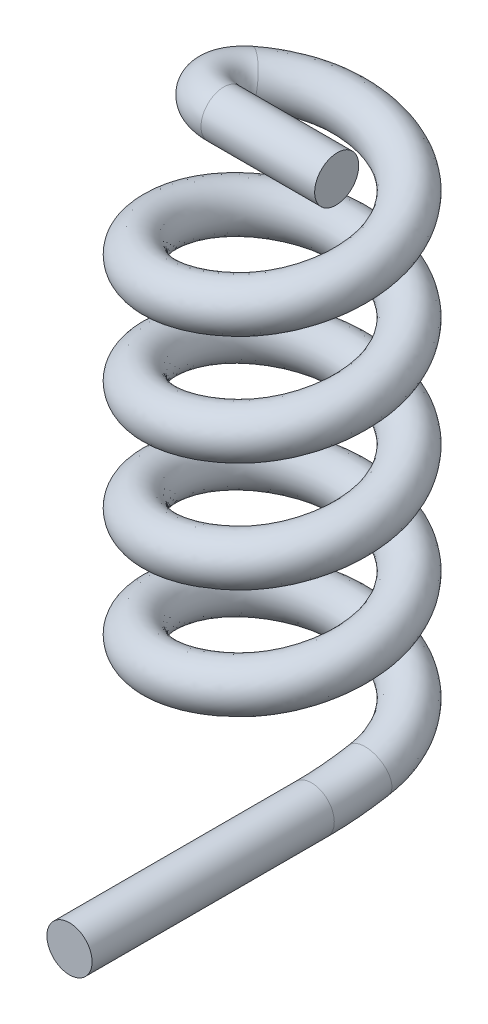
ISO-10303-21;
HEADER;
FILE_DESCRIPTION(('STEP AP214'),'2;1');
FILE_NAME('part.step','',(''),(''),'','','');
FILE_SCHEMA(('AUTOMOTIVE_DESIGN { 1 0 10303 214 1 1 1 1 }'));
ENDSEC;
DATA;
#1=APPLICATION_CONTEXT('core data for automotive mechanical design processes');
#2=APPLICATION_PROTOCOL_DEFINITION('international standard','automotive_design',2000,#1);
#3=PRODUCT_CONTEXT('',#1,'mechanical');
#4=PRODUCT('Part','Part','',(#3));
#5=PRODUCT_RELATED_PRODUCT_CATEGORY('part','',(#4));
#6=PRODUCT_DEFINITION_FORMATION('','',#4);
#7=PRODUCT_DEFINITION_CONTEXT('part definition',#1,'design');
#8=PRODUCT_DEFINITION('design','',#6,#7);
#9=PRODUCT_DEFINITION_SHAPE('','',#8);
#10=(LENGTH_UNIT() NAMED_UNIT(*) SI_UNIT(.MILLI.,.METRE.));
#11=(NAMED_UNIT(*) PLANE_ANGLE_UNIT() SI_UNIT($,.RADIAN.));
#12=(NAMED_UNIT(*) SI_UNIT($,.STERADIAN.) SOLID_ANGLE_UNIT());
#13=UNCERTAINTY_MEASURE_WITH_UNIT(LENGTH_MEASURE(1.E-05),#10,'distance_accuracy_value','');
#14=(GEOMETRIC_REPRESENTATION_CONTEXT(3) GLOBAL_UNCERTAINTY_ASSIGNED_CONTEXT((#13)) GLOBAL_UNIT_ASSIGNED_CONTEXT((#10,
#11,#12)) REPRESENTATION_CONTEXT('',''));
#15=CARTESIAN_POINT('',(0.,0.,0.));
#16=DIRECTION('',(0.,0.,1.));
#17=DIRECTION('',(1.,0.,0.));
#18=AXIS2_PLACEMENT_3D('',#15,#16,#17);
#19=CARTESIAN_POINT('',(0.6,1.96823762445943,0.35502204672712));
#20=DIRECTION('',(1.,0.,0.));
#21=DIRECTION('',(0.,0.,-1.));
#22=AXIS2_PLACEMENT_3D('',#19,#20,#21);
#23=TOROIDAL_SURFACE('',#22,2.,0.14);
#24=CARTESIAN_POINT('',(0.6,-0.0317623755405736,0.35502204672712));
#25=DIRECTION('',(0.,0.,1.));
#26=DIRECTION('',(1.,0.,0.));
#27=AXIS2_PLACEMENT_3D('',#24,#25,#26);
#28=CIRCLE('',#27,0.14);
#29=CARTESIAN_POINT('',(0.6,-0.171762375540574,0.35502204672712));
#30=VERTEX_POINT('',#29);
#31=EDGE_CURVE('E10',#30,#30,#28,.T.);
#32=CARTESIAN_POINT('',(0.6,0.,0.));
#33=DIRECTION('',(0.,0.17751102336356,-0.984118812229713));
#34=DIRECTION('',(0.,0.984118812229713,0.17751102336356));
#35=AXIS2_PLACEMENT_3D('',#32,#33,#34);
#36=CIRCLE('',#35,0.14);
#37=CARTESIAN_POINT('',(0.6,-0.13777663371216,-0.0248515432708984));
#38=VERTEX_POINT('',#37);
#39=EDGE_CURVE('E43',#38,#38,#36,.T.);
#40=CARTESIAN_POINT('',(0.6,1.96823762445943,0.35502204672712));
#41=DIRECTION('',(1.,0.,0.));
#42=DIRECTION('',(0.,0.,-1.));
#43=AXIS2_PLACEMENT_3D('',#40,#41,#42);
#44=CIRCLE('',#43,2.14);
#45=EDGE_CURVE('',#30,#38,#44,.T.);
#46=ORIENTED_EDGE('',*,*,#31,.F.);
#47=ORIENTED_EDGE('',*,*,#39,.F.);
#48=ORIENTED_EDGE('',*,*,#45,.T.);
#49=ORIENTED_EDGE('',*,*,#45,.F.);
#50=EDGE_LOOP('',(#46,#48,#47,#49));
#51=FACE_BOUND('',#50,.T.);
#52=ADVANCED_FACE('F29',(#51),#23,.T.);
#53=CARTESIAN_POINT('',(0.6,-0.0317623755405736,0.35502204672712));
#54=DIRECTION('',(0.,0.,1.));
#55=DIRECTION('',(0.,-1.,0.));
#56=AXIS2_PLACEMENT_3D('',#53,#54,#55);
#57=CYLINDRICAL_SURFACE('',#56,0.14);
#58=ORIENTED_EDGE('',*,*,#31,.T.);
#59=EDGE_LOOP('',(#58));
#60=FACE_BOUND('',#59,.T.);
#61=CARTESIAN_POINT('',(0.6,-0.0317623755405738,1.85502204672712));
#62=DIRECTION('',(0.,0.,1.));
#63=DIRECTION('',(1.,0.,0.));
#64=AXIS2_PLACEMENT_3D('',#61,#62,#63);
#65=CIRCLE('',#64,0.14);
#66=CARTESIAN_POINT('',(0.74,-0.0317623755405738,1.85502204672712));
#67=VERTEX_POINT('',#66);
#68=EDGE_CURVE('E37',#67,#67,#65,.T.);
#69=ORIENTED_EDGE('',*,*,#68,.F.);
#70=EDGE_LOOP('',(#69));
#71=FACE_BOUND('',#70,.T.);
#72=ADVANCED_FACE('F78',(#60,#71),#57,.T.);
#73=CARTESIAN_POINT('',(0.6,-0.0317623755405738,1.85502204672712));
#74=DIRECTION('',(0.,0.,1.));
#75=DIRECTION('',(1.,0.,0.));
#76=AXIS2_PLACEMENT_3D('',#73,#74,#75);
#77=PLANE('',#76);
#78=ORIENTED_EDGE('',*,*,#68,.T.);
#79=EDGE_LOOP('',(#78));
#80=FACE_BOUND('',#79,.T.);
#81=ADVANCED_FACE('F67',(#80),#77,.T.);
#82=CARTESIAN_POINT('',(0.6,0.13777663371216,0.0248515432708983));
#83=CARTESIAN_POINT('',(0.614348045197231,0.194443300378826,-0.321558618242877));
#84=CARTESIAN_POINT('',(0.321522067795846,0.251109967045493,-0.507189470635214));
#85=CARTESIAN_POINT('',(0.0286960903944616,0.307776633712159,-0.692820323027551));
#86=CARTESIAN_POINT('',(-0.278477932204154,0.364443300378826,-0.532041013906112));
#87=CARTESIAN_POINT('',(-0.585651954802769,0.421109967045492,-0.371261704784674));
#88=CARTESIAN_POINT('',(-0.6,0.477776633712159,-0.0248515432708984));
#89=CARTESIAN_POINT('',(-0.614348045197231,0.534443300378825,0.321558618242877));
#90=CARTESIAN_POINT('',(-0.321522067795846,0.591109967045492,0.507189470635214));
#91=CARTESIAN_POINT('',(-0.0286960903944617,0.647776633712159,0.692820323027551));
#92=CARTESIAN_POINT('',(0.278477932204153,0.704443300378825,0.532041013906112));
#93=CARTESIAN_POINT('',(0.585651954802769,0.761109967045492,0.371261704784674));
#94=CARTESIAN_POINT('',(0.6,0.817776633712158,0.0248515432708983));
#95=CARTESIAN_POINT('',(0.614348045197231,0.874443300378825,-0.321558618242877));
#96=CARTESIAN_POINT('',(0.321522067795846,0.931109967045491,-0.507189470635214));
#97=CARTESIAN_POINT('',(0.0286960903944616,0.987776633712158,-0.692820323027551));
#98=CARTESIAN_POINT('',(-0.278477932204154,1.04444330037882,-0.532041013906112));
#99=CARTESIAN_POINT('',(-0.585651954802769,1.10110996704549,-0.371261704784674));
#100=CARTESIAN_POINT('',(-0.6,1.15777663371216,-0.0248515432708984));
#101=CARTESIAN_POINT('',(-0.614348045197231,1.21444330037882,0.321558618242877));
#102=CARTESIAN_POINT('',(-0.321522067795846,1.27110996704549,0.507189470635214));
#103=CARTESIAN_POINT('',(-0.0286960903944617,1.32777663371216,0.692820323027551));
#104=CARTESIAN_POINT('',(0.278477932204153,1.38444330037882,0.532041013906112));
#105=CARTESIAN_POINT('',(0.585651954802769,1.44110996704549,0.371261704784674));
#106=CARTESIAN_POINT('',(0.6,1.49777663371216,0.0248515432708983));
#107=CARTESIAN_POINT('',(0.614348045197231,1.55444330037882,-0.321558618242877));
#108=CARTESIAN_POINT('',(0.321522067795846,1.61110996704549,-0.507189470635214));
#109=CARTESIAN_POINT('',(0.0286960903944616,1.66777663371216,-0.692820323027551));
#110=CARTESIAN_POINT('',(-0.278477932204154,1.72444330037882,-0.532041013906112));
#111=CARTESIAN_POINT('',(-0.585651954802769,1.78110996704549,-0.371261704784674));
#112=CARTESIAN_POINT('',(-0.6,1.83777663371216,-0.0248515432708984));
#113=CARTESIAN_POINT('',(-0.614348045197231,1.89444330037882,0.321558618242877));
#114=CARTESIAN_POINT('',(-0.321522067795846,1.95110996704549,0.507189470635214));
#115=CARTESIAN_POINT('',(-0.0286960903944617,2.00777663371216,0.692820323027551));
#116=CARTESIAN_POINT('',(0.278477932204153,2.06444330037882,0.532041013906112));
#117=CARTESIAN_POINT('',(0.585651954802769,2.12110996704549,0.371261704784674));
#118=CARTESIAN_POINT('',(0.6,2.17777663371215,0.0248515432708983));
#119=CARTESIAN_POINT('',(0.614348045197231,2.23444330037882,-0.321558618242877));
#120=CARTESIAN_POINT('',(0.321522067795846,2.29110996704549,-0.507189470635214));
#121=CARTESIAN_POINT('',(0.0286960903944616,2.34777663371215,-0.692820323027551));
#122=CARTESIAN_POINT('',(-0.278477932204154,2.40444330037882,-0.532041013906112));
#123=CARTESIAN_POINT('',(-0.585651954802769,2.46110996704549,-0.371261704784674));
#124=CARTESIAN_POINT('',(-0.6,2.51777663371215,-0.0248515432708984));
#125=CARTESIAN_POINT('',(-0.614348045197231,2.57444330037882,0.321558618242877));
#126=CARTESIAN_POINT('',(-0.321522067795846,2.63110996704549,0.507189470635214));
#127=CARTESIAN_POINT('',(-0.0286960903944617,2.68777663371215,0.692820323027551));
#128=CARTESIAN_POINT('',(0.278477932204153,2.74444330037882,0.532041013906112));
#129=CARTESIAN_POINT('',(0.585651954802769,2.80110996704549,0.371261704784674));
#130=CARTESIAN_POINT('',(0.6,2.85777663371215,0.0248515432708983));
#131=CARTESIAN_POINT('',(0.614348045197231,2.91444330037882,-0.321558618242877));
#132=CARTESIAN_POINT('',(0.321522067795846,2.97110996704549,-0.507189470635214));
#133=CARTESIAN_POINT('',(0.0286960903944616,3.02777663371215,-0.692820323027551));
#134=CARTESIAN_POINT('',(-0.278477932204154,3.08444330037882,-0.532041013906112));
#135=CARTESIAN_POINT('',(-0.585651954802769,3.14110996704549,-0.371261704784674));
#136=CARTESIAN_POINT('',(-0.6,3.19777663371215,-0.0248515432708984));
#137=CARTESIAN_POINT('',(-0.614348045197231,3.25444330037882,0.321558618242877));
#138=CARTESIAN_POINT('',(-0.321522067795846,3.31110996704549,0.507189470635214));
#139=CARTESIAN_POINT('',(-0.0286960903944617,3.36777663371215,0.692820323027551));
#140=CARTESIAN_POINT('',(0.278477932204153,3.42444330037882,0.532041013906112));
#141=CARTESIAN_POINT('',(0.585651954802769,3.48110996704549,0.371261704784674));
#142=CARTESIAN_POINT('',(0.6,3.53777663371215,0.0248515432708983));
#143=CARTESIAN_POINT('',(0.88,0.13777663371216,0.0248515432708983));
#144=CARTESIAN_POINT('',(0.894348045197231,0.194443300378826,-0.483216693615972));
#145=CARTESIAN_POINT('',(0.461522067795846,0.251109967045493,-0.749676583694857));
#146=CARTESIAN_POINT('',(0.0286960903944616,0.307776633712159,-1.01613647377374));
#147=CARTESIAN_POINT('',(-0.418477932204153,0.364443300378826,-0.774528126965755));
#148=CARTESIAN_POINT('',(-0.865651954802769,0.421109967045492,-0.532919780157769));
#149=CARTESIAN_POINT('',(-0.88,0.477776633712159,-0.0248515432708984));
#150=CARTESIAN_POINT('',(-0.894348045197231,0.534443300378825,0.483216693615972));
#151=CARTESIAN_POINT('',(-0.461522067795846,0.591109967045492,0.749676583694856));
#152=CARTESIAN_POINT('',(-0.0286960903944618,0.647776633712159,1.01613647377374));
#153=CARTESIAN_POINT('',(0.418477932204153,0.704443300378825,0.774528126965755));
#154=CARTESIAN_POINT('',(0.865651954802769,0.761109967045492,0.532919780157769));
#155=CARTESIAN_POINT('',(0.88,0.817776633712158,0.0248515432708983));
#156=CARTESIAN_POINT('',(0.894348045197231,0.874443300378825,-0.483216693615972));
#157=CARTESIAN_POINT('',(0.461522067795846,0.931109967045491,-0.749676583694857));
#158=CARTESIAN_POINT('',(0.0286960903944616,0.987776633712158,-1.01613647377374));
#159=CARTESIAN_POINT('',(-0.418477932204153,1.04444330037882,-0.774528126965755));
#160=CARTESIAN_POINT('',(-0.865651954802769,1.10110996704549,-0.532919780157769));
#161=CARTESIAN_POINT('',(-0.88,1.15777663371216,-0.0248515432708984));
#162=CARTESIAN_POINT('',(-0.894348045197231,1.21444330037882,0.483216693615972));
#163=CARTESIAN_POINT('',(-0.461522067795846,1.27110996704549,0.749676583694856));
#164=CARTESIAN_POINT('',(-0.0286960903944618,1.32777663371216,1.01613647377374));
#165=CARTESIAN_POINT('',(0.418477932204153,1.38444330037882,0.774528126965755));
#166=CARTESIAN_POINT('',(0.865651954802769,1.44110996704549,0.532919780157769));
#167=CARTESIAN_POINT('',(0.88,1.49777663371216,0.0248515432708983));
#168=CARTESIAN_POINT('',(0.894348045197231,1.55444330037882,-0.483216693615972));
#169=CARTESIAN_POINT('',(0.461522067795846,1.61110996704549,-0.749676583694857));
#170=CARTESIAN_POINT('',(0.0286960903944616,1.66777663371216,-1.01613647377374));
#171=CARTESIAN_POINT('',(-0.418477932204153,1.72444330037882,-0.774528126965755));
#172=CARTESIAN_POINT('',(-0.865651954802769,1.78110996704549,-0.532919780157769));
#173=CARTESIAN_POINT('',(-0.88,1.83777663371216,-0.0248515432708984));
#174=CARTESIAN_POINT('',(-0.894348045197231,1.89444330037882,0.483216693615972));
#175=CARTESIAN_POINT('',(-0.461522067795846,1.95110996704549,0.749676583694856));
#176=CARTESIAN_POINT('',(-0.0286960903944618,2.00777663371216,1.01613647377374));
#177=CARTESIAN_POINT('',(0.418477932204153,2.06444330037882,0.774528126965755));
#178=CARTESIAN_POINT('',(0.865651954802769,2.12110996704549,0.532919780157769));
#179=CARTESIAN_POINT('',(0.88,2.17777663371215,0.0248515432708983));
#180=CARTESIAN_POINT('',(0.894348045197231,2.23444330037882,-0.483216693615972));
#181=CARTESIAN_POINT('',(0.461522067795846,2.29110996704549,-0.749676583694857));
#182=CARTESIAN_POINT('',(0.0286960903944616,2.34777663371215,-1.01613647377374));
#183=CARTESIAN_POINT('',(-0.418477932204153,2.40444330037882,-0.774528126965755));
#184=CARTESIAN_POINT('',(-0.865651954802769,2.46110996704549,-0.532919780157769));
#185=CARTESIAN_POINT('',(-0.88,2.51777663371215,-0.0248515432708984));
#186=CARTESIAN_POINT('',(-0.894348045197231,2.57444330037882,0.483216693615972));
#187=CARTESIAN_POINT('',(-0.461522067795846,2.63110996704549,0.749676583694856));
#188=CARTESIAN_POINT('',(-0.0286960903944618,2.68777663371215,1.01613647377374));
#189=CARTESIAN_POINT('',(0.418477932204153,2.74444330037882,0.774528126965755));
#190=CARTESIAN_POINT('',(0.865651954802769,2.80110996704549,0.532919780157769));
#191=CARTESIAN_POINT('',(0.88,2.85777663371215,0.0248515432708983));
#192=CARTESIAN_POINT('',(0.894348045197231,2.91444330037882,-0.483216693615972));
#193=CARTESIAN_POINT('',(0.461522067795846,2.97110996704549,-0.749676583694857));
#194=CARTESIAN_POINT('',(0.0286960903944616,3.02777663371215,-1.01613647377374));
#195=CARTESIAN_POINT('',(-0.418477932204153,3.08444330037882,-0.774528126965755));
#196=CARTESIAN_POINT('',(-0.865651954802769,3.14110996704549,-0.532919780157769));
#197=CARTESIAN_POINT('',(-0.88,3.19777663371215,-0.0248515432708984));
#198=CARTESIAN_POINT('',(-0.894348045197231,3.25444330037882,0.483216693615972));
#199=CARTESIAN_POINT('',(-0.461522067795846,3.31110996704549,0.749676583694856));
#200=CARTESIAN_POINT('',(-0.0286960903944618,3.36777663371215,1.01613647377374));
#201=CARTESIAN_POINT('',(0.418477932204153,3.42444330037882,0.774528126965755));
#202=CARTESIAN_POINT('',(0.865651954802769,3.48110996704549,0.532919780157769));
#203=CARTESIAN_POINT('',(0.88,3.53777663371215,0.0248515432708983));
#204=CARTESIAN_POINT('',(0.88,-0.13777663371216,-0.0248515432708984));
#205=CARTESIAN_POINT('',(0.865651954802769,-0.0811099670454935,-0.532919780157769));
#206=CARTESIAN_POINT('',(0.418477932204154,-0.0244433003788269,-0.774528126965755));
#207=CARTESIAN_POINT('',(-0.0286960903944616,0.0322233662878396,-1.01613647377374));
#208=CARTESIAN_POINT('',(-0.461522067795846,0.0888900329545061,-0.749676583694857));
#209=CARTESIAN_POINT('',(-0.89434804519723,0.145556699621173,-0.483216693615973));
#210=CARTESIAN_POINT('',(-0.88,0.202223366287839,0.0248515432708983));
#211=CARTESIAN_POINT('',(-0.865651954802769,0.258890032954506,0.532919780157769));
#212=CARTESIAN_POINT('',(-0.418477932204154,0.315556699621172,0.774528126965755));
#213=CARTESIAN_POINT('',(0.0286960903944615,0.372223366287839,1.01613647377374));
#214=CARTESIAN_POINT('',(0.461522067795846,0.428890032954505,0.749676583694857));
#215=CARTESIAN_POINT('',(0.89434804519723,0.485556699621172,0.483216693615973));
#216=CARTESIAN_POINT('',(0.88,0.542223366287839,-0.0248515432708984));
#217=CARTESIAN_POINT('',(0.865651954802769,0.598890032954505,-0.532919780157769));
#218=CARTESIAN_POINT('',(0.418477932204154,0.655556699621171,-0.774528126965755));
#219=CARTESIAN_POINT('',(-0.0286960903944616,0.712223366287838,-1.01613647377374));
#220=CARTESIAN_POINT('',(-0.461522067795846,0.768890032954505,-0.749676583694857));
#221=CARTESIAN_POINT('',(-0.89434804519723,0.825556699621171,-0.483216693615973));
#222=CARTESIAN_POINT('',(-0.88,0.882223366287838,0.0248515432708983));
#223=CARTESIAN_POINT('',(-0.865651954802769,0.938890032954504,0.532919780157769));
#224=CARTESIAN_POINT('',(-0.418477932204154,0.995556699621171,0.774528126965755));
#225=CARTESIAN_POINT('',(0.0286960903944615,1.05222336628784,1.01613647377374));
#226=CARTESIAN_POINT('',(0.461522067795846,1.1088900329545,0.749676583694857));
#227=CARTESIAN_POINT('',(0.89434804519723,1.16555669962117,0.483216693615973));
#228=CARTESIAN_POINT('',(0.88,1.22222336628784,-0.0248515432708984));
#229=CARTESIAN_POINT('',(0.865651954802769,1.2788900329545,-0.532919780157769));
#230=CARTESIAN_POINT('',(0.418477932204154,1.33555669962117,-0.774528126965755));
#231=CARTESIAN_POINT('',(-0.0286960903944616,1.39222336628784,-1.01613647377374));
#232=CARTESIAN_POINT('',(-0.461522067795846,1.4488900329545,-0.749676583694857));
#233=CARTESIAN_POINT('',(-0.89434804519723,1.50555669962117,-0.483216693615973));
#234=CARTESIAN_POINT('',(-0.88,1.56222336628784,0.0248515432708983));
#235=CARTESIAN_POINT('',(-0.865651954802769,1.6188900329545,0.532919780157769));
#236=CARTESIAN_POINT('',(-0.418477932204154,1.67555669962117,0.774528126965755));
#237=CARTESIAN_POINT('',(0.0286960903944615,1.73222336628784,1.01613647377374));
#238=CARTESIAN_POINT('',(0.461522067795846,1.7888900329545,0.749676583694857));
#239=CARTESIAN_POINT('',(0.89434804519723,1.84555669962117,0.483216693615973));
#240=CARTESIAN_POINT('',(0.88,1.90222336628784,-0.0248515432708984));
#241=CARTESIAN_POINT('',(0.865651954802769,1.9588900329545,-0.532919780157769));
#242=CARTESIAN_POINT('',(0.418477932204154,2.01555669962117,-0.774528126965755));
#243=CARTESIAN_POINT('',(-0.0286960903944616,2.07222336628783,-1.01613647377374));
#244=CARTESIAN_POINT('',(-0.461522067795846,2.1288900329545,-0.749676583694857));
#245=CARTESIAN_POINT('',(-0.89434804519723,2.18555669962117,-0.483216693615973));
#246=CARTESIAN_POINT('',(-0.88,2.24222336628783,0.0248515432708983));
#247=CARTESIAN_POINT('',(-0.865651954802769,2.2988900329545,0.532919780157769));
#248=CARTESIAN_POINT('',(-0.418477932204154,2.35555669962117,0.774528126965755));
#249=CARTESIAN_POINT('',(0.0286960903944615,2.41222336628783,1.01613647377374));
#250=CARTESIAN_POINT('',(0.461522067795846,2.4688900329545,0.749676583694857));
#251=CARTESIAN_POINT('',(0.89434804519723,2.52555669962117,0.483216693615973));
#252=CARTESIAN_POINT('',(0.88,2.58222336628783,-0.0248515432708984));
#253=CARTESIAN_POINT('',(0.865651954802769,2.6388900329545,-0.532919780157769));
#254=CARTESIAN_POINT('',(0.418477932204154,2.69555669962117,-0.774528126965755));
#255=CARTESIAN_POINT('',(-0.0286960903944616,2.75222336628783,-1.01613647377374));
#256=CARTESIAN_POINT('',(-0.461522067795846,2.8088900329545,-0.749676583694857));
#257=CARTESIAN_POINT('',(-0.89434804519723,2.86555669962117,-0.483216693615973));
#258=CARTESIAN_POINT('',(-0.88,2.92222336628783,0.0248515432708983));
#259=CARTESIAN_POINT('',(-0.865651954802769,2.9788900329545,0.532919780157769));
#260=CARTESIAN_POINT('',(-0.418477932204154,3.03555669962117,0.774528126965755));
#261=CARTESIAN_POINT('',(0.0286960903944615,3.09222336628783,1.01613647377374));
#262=CARTESIAN_POINT('',(0.461522067795846,3.1488900329545,0.749676583694857));
#263=CARTESIAN_POINT('',(0.89434804519723,3.20555669962117,0.483216693615973));
#264=CARTESIAN_POINT('',(0.88,3.26222336628783,-0.0248515432708984));
#265=CARTESIAN_POINT('',(0.6,-0.13777663371216,-0.0248515432708984));
#266=CARTESIAN_POINT('',(0.585651954802769,-0.0811099670454935,-0.371261704784674));
#267=CARTESIAN_POINT('',(0.278477932204154,-0.024443300378827,-0.532041013906112));
#268=CARTESIAN_POINT('',(-0.0286960903944616,0.0322233662878396,-0.692820323027551));
#269=CARTESIAN_POINT('',(-0.321522067795846,0.0888900329545061,-0.507189470635214));
#270=CARTESIAN_POINT('',(-0.614348045197231,0.145556699621173,-0.321558618242877));
#271=CARTESIAN_POINT('',(-0.6,0.202223366287839,0.0248515432708983));
#272=CARTESIAN_POINT('',(-0.585651954802769,0.258890032954506,0.371261704784674));
#273=CARTESIAN_POINT('',(-0.278477932204154,0.315556699621172,0.532041013906112));
#274=CARTESIAN_POINT('',(0.0286960903944615,0.372223366287839,0.692820323027551));
#275=CARTESIAN_POINT('',(0.321522067795846,0.428890032954505,0.507189470635214));
#276=CARTESIAN_POINT('',(0.614348045197231,0.485556699621172,0.321558618242877));
#277=CARTESIAN_POINT('',(0.6,0.542223366287839,-0.0248515432708984));
#278=CARTESIAN_POINT('',(0.585651954802769,0.598890032954505,-0.371261704784674));
#279=CARTESIAN_POINT('',(0.278477932204154,0.655556699621171,-0.532041013906112));
#280=CARTESIAN_POINT('',(-0.0286960903944616,0.712223366287838,-0.692820323027551));
#281=CARTESIAN_POINT('',(-0.321522067795846,0.768890032954505,-0.507189470635214));
#282=CARTESIAN_POINT('',(-0.614348045197231,0.825556699621171,-0.321558618242877));
#283=CARTESIAN_POINT('',(-0.6,0.882223366287838,0.0248515432708983));
#284=CARTESIAN_POINT('',(-0.585651954802769,0.938890032954504,0.371261704784674));
#285=CARTESIAN_POINT('',(-0.278477932204154,0.995556699621171,0.532041013906112));
#286=CARTESIAN_POINT('',(0.0286960903944615,1.05222336628784,0.692820323027551));
#287=CARTESIAN_POINT('',(0.321522067795846,1.1088900329545,0.507189470635214));
#288=CARTESIAN_POINT('',(0.614348045197231,1.16555669962117,0.321558618242877));
#289=CARTESIAN_POINT('',(0.6,1.22222336628784,-0.0248515432708984));
#290=CARTESIAN_POINT('',(0.585651954802769,1.2788900329545,-0.371261704784674));
#291=CARTESIAN_POINT('',(0.278477932204154,1.33555669962117,-0.532041013906112));
#292=CARTESIAN_POINT('',(-0.0286960903944616,1.39222336628784,-0.692820323027551));
#293=CARTESIAN_POINT('',(-0.321522067795846,1.4488900329545,-0.507189470635214));
#294=CARTESIAN_POINT('',(-0.614348045197231,1.50555669962117,-0.321558618242877));
#295=CARTESIAN_POINT('',(-0.6,1.56222336628784,0.0248515432708983));
#296=CARTESIAN_POINT('',(-0.585651954802769,1.6188900329545,0.371261704784674));
#297=CARTESIAN_POINT('',(-0.278477932204154,1.67555669962117,0.532041013906112));
#298=CARTESIAN_POINT('',(0.0286960903944615,1.73222336628784,0.692820323027551));
#299=CARTESIAN_POINT('',(0.321522067795846,1.7888900329545,0.507189470635214));
#300=CARTESIAN_POINT('',(0.614348045197231,1.84555669962117,0.321558618242877));
#301=CARTESIAN_POINT('',(0.6,1.90222336628784,-0.0248515432708984));
#302=CARTESIAN_POINT('',(0.585651954802769,1.9588900329545,-0.371261704784674));
#303=CARTESIAN_POINT('',(0.278477932204154,2.01555669962117,-0.532041013906112));
#304=CARTESIAN_POINT('',(-0.0286960903944616,2.07222336628783,-0.692820323027551));
#305=CARTESIAN_POINT('',(-0.321522067795846,2.1288900329545,-0.507189470635214));
#306=CARTESIAN_POINT('',(-0.614348045197231,2.18555669962117,-0.321558618242877));
#307=CARTESIAN_POINT('',(-0.6,2.24222336628783,0.0248515432708983));
#308=CARTESIAN_POINT('',(-0.585651954802769,2.2988900329545,0.371261704784674));
#309=CARTESIAN_POINT('',(-0.278477932204154,2.35555669962117,0.532041013906112));
#310=CARTESIAN_POINT('',(0.0286960903944615,2.41222336628783,0.692820323027551));
#311=CARTESIAN_POINT('',(0.321522067795846,2.4688900329545,0.507189470635214));
#312=CARTESIAN_POINT('',(0.614348045197231,2.52555669962117,0.321558618242877));
#313=CARTESIAN_POINT('',(0.6,2.58222336628783,-0.0248515432708984));
#314=CARTESIAN_POINT('',(0.585651954802769,2.6388900329545,-0.371261704784674));
#315=CARTESIAN_POINT('',(0.278477932204154,2.69555669962117,-0.532041013906112));
#316=CARTESIAN_POINT('',(-0.0286960903944616,2.75222336628783,-0.692820323027551));
#317=CARTESIAN_POINT('',(-0.321522067795846,2.8088900329545,-0.507189470635214));
#318=CARTESIAN_POINT('',(-0.614348045197231,2.86555669962117,-0.321558618242877));
#319=CARTESIAN_POINT('',(-0.6,2.92222336628783,0.0248515432708983));
#320=CARTESIAN_POINT('',(-0.585651954802769,2.9788900329545,0.371261704784674));
#321=CARTESIAN_POINT('',(-0.278477932204154,3.03555669962117,0.532041013906112));
#322=CARTESIAN_POINT('',(0.0286960903944615,3.09222336628783,0.692820323027551));
#323=CARTESIAN_POINT('',(0.321522067795846,3.1488900329545,0.507189470635214));
#324=CARTESIAN_POINT('',(0.614348045197231,3.20555669962117,0.321558618242877));
#325=CARTESIAN_POINT('',(0.6,3.26222336628783,-0.0248515432708984));
#326=CARTESIAN_POINT('',(0.32,-0.13777663371216,-0.0248515432708984));
#327=CARTESIAN_POINT('',(0.305651954802769,-0.0811099670454936,-0.209603629411579));
#328=CARTESIAN_POINT('',(0.138477932204154,-0.024443300378827,-0.28955390084647));
#329=CARTESIAN_POINT('',(-0.0286960903944616,0.0322233662878396,-0.36950417228136));
#330=CARTESIAN_POINT('',(-0.181522067795846,0.0888900329545061,-0.264702357575571));
#331=CARTESIAN_POINT('',(-0.334348045197231,0.145556699621173,-0.159900542869782));
#332=CARTESIAN_POINT('',(-0.32,0.202223366287839,0.0248515432708984));
#333=CARTESIAN_POINT('',(-0.305651954802769,0.258890032954506,0.209603629411579));
#334=CARTESIAN_POINT('',(-0.138477932204154,0.315556699621172,0.289553900846469));
#335=CARTESIAN_POINT('',(0.0286960903944616,0.372223366287839,0.36950417228136));
#336=CARTESIAN_POINT('',(0.181522067795846,0.428890032954505,0.264702357575571));
#337=CARTESIAN_POINT('',(0.334348045197231,0.485556699621172,0.159900542869782));
#338=CARTESIAN_POINT('',(0.32,0.542223366287839,-0.0248515432708984));
#339=CARTESIAN_POINT('',(0.305651954802769,0.598890032954505,-0.209603629411579));
#340=CARTESIAN_POINT('',(0.138477932204154,0.655556699621171,-0.28955390084647));
#341=CARTESIAN_POINT('',(-0.0286960903944616,0.712223366287838,-0.36950417228136));
#342=CARTESIAN_POINT('',(-0.181522067795846,0.768890032954505,-0.264702357575571));
#343=CARTESIAN_POINT('',(-0.334348045197231,0.825556699621171,-0.159900542869782));
#344=CARTESIAN_POINT('',(-0.32,0.882223366287838,0.0248515432708984));
#345=CARTESIAN_POINT('',(-0.305651954802769,0.938890032954504,0.209603629411579));
#346=CARTESIAN_POINT('',(-0.138477932204154,0.995556699621171,0.289553900846469));
#347=CARTESIAN_POINT('',(0.0286960903944616,1.05222336628784,0.36950417228136));
#348=CARTESIAN_POINT('',(0.181522067795846,1.1088900329545,0.264702357575571));
#349=CARTESIAN_POINT('',(0.334348045197231,1.16555669962117,0.159900542869782));
#350=CARTESIAN_POINT('',(0.32,1.22222336628784,-0.0248515432708984));
#351=CARTESIAN_POINT('',(0.305651954802769,1.2788900329545,-0.209603629411579));
#352=CARTESIAN_POINT('',(0.138477932204154,1.33555669962117,-0.28955390084647));
#353=CARTESIAN_POINT('',(-0.0286960903944616,1.39222336628784,-0.36950417228136));
#354=CARTESIAN_POINT('',(-0.181522067795846,1.4488900329545,-0.264702357575571));
#355=CARTESIAN_POINT('',(-0.334348045197231,1.50555669962117,-0.159900542869782));
#356=CARTESIAN_POINT('',(-0.32,1.56222336628784,0.0248515432708984));
#357=CARTESIAN_POINT('',(-0.305651954802769,1.6188900329545,0.209603629411579));
#358=CARTESIAN_POINT('',(-0.138477932204154,1.67555669962117,0.289553900846469));
#359=CARTESIAN_POINT('',(0.0286960903944616,1.73222336628784,0.36950417228136));
#360=CARTESIAN_POINT('',(0.181522067795846,1.7888900329545,0.264702357575571));
#361=CARTESIAN_POINT('',(0.334348045197231,1.84555669962117,0.159900542869782));
#362=CARTESIAN_POINT('',(0.32,1.90222336628784,-0.0248515432708984));
#363=CARTESIAN_POINT('',(0.305651954802769,1.9588900329545,-0.209603629411579));
#364=CARTESIAN_POINT('',(0.138477932204154,2.01555669962117,-0.28955390084647));
#365=CARTESIAN_POINT('',(-0.0286960903944616,2.07222336628783,-0.36950417228136));
#366=CARTESIAN_POINT('',(-0.181522067795846,2.1288900329545,-0.264702357575571));
#367=CARTESIAN_POINT('',(-0.334348045197231,2.18555669962117,-0.159900542869782));
#368=CARTESIAN_POINT('',(-0.32,2.24222336628783,0.0248515432708984));
#369=CARTESIAN_POINT('',(-0.305651954802769,2.2988900329545,0.209603629411579));
#370=CARTESIAN_POINT('',(-0.138477932204154,2.35555669962117,0.289553900846469));
#371=CARTESIAN_POINT('',(0.0286960903944616,2.41222336628783,0.36950417228136));
#372=CARTESIAN_POINT('',(0.181522067795846,2.4688900329545,0.264702357575571));
#373=CARTESIAN_POINT('',(0.334348045197231,2.52555669962117,0.159900542869782));
#374=CARTESIAN_POINT('',(0.32,2.58222336628783,-0.0248515432708984));
#375=CARTESIAN_POINT('',(0.305651954802769,2.6388900329545,-0.209603629411579));
#376=CARTESIAN_POINT('',(0.138477932204154,2.69555669962117,-0.28955390084647));
#377=CARTESIAN_POINT('',(-0.0286960903944616,2.75222336628783,-0.36950417228136));
#378=CARTESIAN_POINT('',(-0.181522067795846,2.8088900329545,-0.264702357575571));
#379=CARTESIAN_POINT('',(-0.334348045197231,2.86555669962117,-0.159900542869782));
#380=CARTESIAN_POINT('',(-0.32,2.92222336628783,0.0248515432708984));
#381=CARTESIAN_POINT('',(-0.305651954802769,2.9788900329545,0.209603629411579));
#382=CARTESIAN_POINT('',(-0.138477932204154,3.03555669962117,0.289553900846469));
#383=CARTESIAN_POINT('',(0.0286960903944616,3.09222336628783,0.36950417228136));
#384=CARTESIAN_POINT('',(0.181522067795846,3.1488900329545,0.264702357575571));
#385=CARTESIAN_POINT('',(0.334348045197231,3.20555669962117,0.159900542869782));
#386=CARTESIAN_POINT('',(0.32,3.26222336628783,-0.0248515432708984));
#387=CARTESIAN_POINT('',(0.32,0.13777663371216,0.0248515432708983));
#388=CARTESIAN_POINT('',(0.334348045197231,0.194443300378826,-0.159900542869782));
#389=CARTESIAN_POINT('',(0.181522067795846,0.251109967045493,-0.264702357575571));
#390=CARTESIAN_POINT('',(0.0286960903944616,0.307776633712159,-0.36950417228136));
#391=CARTESIAN_POINT('',(-0.138477932204154,0.364443300378826,-0.28955390084647));
#392=CARTESIAN_POINT('',(-0.305651954802769,0.421109967045492,-0.209603629411579));
#393=CARTESIAN_POINT('',(-0.32,0.477776633712159,-0.0248515432708984));
#394=CARTESIAN_POINT('',(-0.334348045197231,0.534443300378825,0.159900542869782));
#395=CARTESIAN_POINT('',(-0.181522067795846,0.591109967045492,0.264702357575571));
#396=CARTESIAN_POINT('',(-0.0286960903944616,0.647776633712159,0.36950417228136));
#397=CARTESIAN_POINT('',(0.138477932204154,0.704443300378825,0.28955390084647));
#398=CARTESIAN_POINT('',(0.305651954802769,0.761109967045492,0.209603629411579));
#399=CARTESIAN_POINT('',(0.32,0.817776633712158,0.0248515432708983));
#400=CARTESIAN_POINT('',(0.334348045197231,0.874443300378825,-0.159900542869782));
#401=CARTESIAN_POINT('',(0.181522067795846,0.931109967045491,-0.264702357575571));
#402=CARTESIAN_POINT('',(0.0286960903944616,0.987776633712158,-0.36950417228136));
#403=CARTESIAN_POINT('',(-0.138477932204154,1.04444330037882,-0.28955390084647));
#404=CARTESIAN_POINT('',(-0.305651954802769,1.10110996704549,-0.209603629411579));
#405=CARTESIAN_POINT('',(-0.32,1.15777663371216,-0.0248515432708984));
#406=CARTESIAN_POINT('',(-0.334348045197231,1.21444330037882,0.159900542869782));
#407=CARTESIAN_POINT('',(-0.181522067795846,1.27110996704549,0.264702357575571));
#408=CARTESIAN_POINT('',(-0.0286960903944616,1.32777663371216,0.36950417228136));
#409=CARTESIAN_POINT('',(0.138477932204154,1.38444330037882,0.28955390084647));
#410=CARTESIAN_POINT('',(0.305651954802769,1.44110996704549,0.209603629411579));
#411=CARTESIAN_POINT('',(0.32,1.49777663371216,0.0248515432708983));
#412=CARTESIAN_POINT('',(0.334348045197231,1.55444330037882,-0.159900542869782));
#413=CARTESIAN_POINT('',(0.181522067795846,1.61110996704549,-0.264702357575571));
#414=CARTESIAN_POINT('',(0.0286960903944616,1.66777663371216,-0.36950417228136));
#415=CARTESIAN_POINT('',(-0.138477932204154,1.72444330037882,-0.28955390084647));
#416=CARTESIAN_POINT('',(-0.305651954802769,1.78110996704549,-0.209603629411579));
#417=CARTESIAN_POINT('',(-0.32,1.83777663371216,-0.0248515432708984));
#418=CARTESIAN_POINT('',(-0.334348045197231,1.89444330037882,0.159900542869782));
#419=CARTESIAN_POINT('',(-0.181522067795846,1.95110996704549,0.264702357575571));
#420=CARTESIAN_POINT('',(-0.0286960903944616,2.00777663371216,0.36950417228136));
#421=CARTESIAN_POINT('',(0.138477932204154,2.06444330037882,0.28955390084647));
#422=CARTESIAN_POINT('',(0.305651954802769,2.12110996704549,0.209603629411579));
#423=CARTESIAN_POINT('',(0.32,2.17777663371215,0.0248515432708983));
#424=CARTESIAN_POINT('',(0.334348045197231,2.23444330037882,-0.159900542869782));
#425=CARTESIAN_POINT('',(0.181522067795846,2.29110996704549,-0.264702357575571));
#426=CARTESIAN_POINT('',(0.0286960903944616,2.34777663371215,-0.36950417228136));
#427=CARTESIAN_POINT('',(-0.138477932204154,2.40444330037882,-0.28955390084647));
#428=CARTESIAN_POINT('',(-0.305651954802769,2.46110996704549,-0.209603629411579));
#429=CARTESIAN_POINT('',(-0.32,2.51777663371215,-0.0248515432708984));
#430=CARTESIAN_POINT('',(-0.334348045197231,2.57444330037882,0.159900542869782));
#431=CARTESIAN_POINT('',(-0.181522067795846,2.63110996704549,0.264702357575571));
#432=CARTESIAN_POINT('',(-0.0286960903944616,2.68777663371215,0.36950417228136));
#433=CARTESIAN_POINT('',(0.138477932204154,2.74444330037882,0.28955390084647));
#434=CARTESIAN_POINT('',(0.305651954802769,2.80110996704549,0.209603629411579));
#435=CARTESIAN_POINT('',(0.32,2.85777663371215,0.0248515432708983));
#436=CARTESIAN_POINT('',(0.334348045197231,2.91444330037882,-0.159900542869782));
#437=CARTESIAN_POINT('',(0.181522067795846,2.97110996704549,-0.264702357575571));
#438=CARTESIAN_POINT('',(0.0286960903944616,3.02777663371215,-0.36950417228136));
#439=CARTESIAN_POINT('',(-0.138477932204154,3.08444330037882,-0.28955390084647));
#440=CARTESIAN_POINT('',(-0.305651954802769,3.14110996704549,-0.209603629411579));
#441=CARTESIAN_POINT('',(-0.32,3.19777663371215,-0.0248515432708984));
#442=CARTESIAN_POINT('',(-0.334348045197231,3.25444330037882,0.159900542869782));
#443=CARTESIAN_POINT('',(-0.181522067795846,3.31110996704549,0.264702357575571));
#444=CARTESIAN_POINT('',(-0.0286960903944616,3.36777663371215,0.36950417228136));
#445=CARTESIAN_POINT('',(0.138477932204154,3.42444330037882,0.28955390084647));
#446=CARTESIAN_POINT('',(0.305651954802769,3.48110996704549,0.209603629411579));
#447=CARTESIAN_POINT('',(0.32,3.53777663371215,0.0248515432708983));
#448=CARTESIAN_POINT('',(0.6,0.13777663371216,0.0248515432708983));
#449=CARTESIAN_POINT('',(0.614348045197231,0.194443300378826,-0.321558618242877));
#450=CARTESIAN_POINT('',(0.321522067795846,0.251109967045493,-0.507189470635214));
#451=CARTESIAN_POINT('',(0.0286960903944616,0.307776633712159,-0.692820323027551));
#452=CARTESIAN_POINT('',(-0.278477932204154,0.364443300378826,-0.532041013906112));
#453=CARTESIAN_POINT('',(-0.585651954802769,0.421109967045492,-0.371261704784674));
#454=CARTESIAN_POINT('',(-0.6,0.477776633712159,-0.0248515432708984));
#455=CARTESIAN_POINT('',(-0.614348045197231,0.534443300378825,0.321558618242877));
#456=CARTESIAN_POINT('',(-0.321522067795846,0.591109967045492,0.507189470635214));
#457=CARTESIAN_POINT('',(-0.0286960903944617,0.647776633712159,0.692820323027551));
#458=CARTESIAN_POINT('',(0.278477932204153,0.704443300378825,0.532041013906112));
#459=CARTESIAN_POINT('',(0.585651954802769,0.761109967045492,0.371261704784674));
#460=CARTESIAN_POINT('',(0.6,0.817776633712158,0.0248515432708983));
#461=CARTESIAN_POINT('',(0.614348045197231,0.874443300378825,-0.321558618242877));
#462=CARTESIAN_POINT('',(0.321522067795846,0.931109967045491,-0.507189470635214));
#463=CARTESIAN_POINT('',(0.0286960903944616,0.987776633712158,-0.692820323027551));
#464=CARTESIAN_POINT('',(-0.278477932204154,1.04444330037882,-0.532041013906112));
#465=CARTESIAN_POINT('',(-0.585651954802769,1.10110996704549,-0.371261704784674));
#466=CARTESIAN_POINT('',(-0.6,1.15777663371216,-0.0248515432708984));
#467=CARTESIAN_POINT('',(-0.614348045197231,1.21444330037882,0.321558618242877));
#468=CARTESIAN_POINT('',(-0.321522067795846,1.27110996704549,0.507189470635214));
#469=CARTESIAN_POINT('',(-0.0286960903944617,1.32777663371216,0.692820323027551));
#470=CARTESIAN_POINT('',(0.278477932204153,1.38444330037882,0.532041013906112));
#471=CARTESIAN_POINT('',(0.585651954802769,1.44110996704549,0.371261704784674));
#472=CARTESIAN_POINT('',(0.6,1.49777663371216,0.0248515432708983));
#473=CARTESIAN_POINT('',(0.614348045197231,1.55444330037882,-0.321558618242877));
#474=CARTESIAN_POINT('',(0.321522067795846,1.61110996704549,-0.507189470635214));
#475=CARTESIAN_POINT('',(0.0286960903944616,1.66777663371216,-0.692820323027551));
#476=CARTESIAN_POINT('',(-0.278477932204154,1.72444330037882,-0.532041013906112));
#477=CARTESIAN_POINT('',(-0.585651954802769,1.78110996704549,-0.371261704784674));
#478=CARTESIAN_POINT('',(-0.6,1.83777663371216,-0.0248515432708984));
#479=CARTESIAN_POINT('',(-0.614348045197231,1.89444330037882,0.321558618242877));
#480=CARTESIAN_POINT('',(-0.321522067795846,1.95110996704549,0.507189470635214));
#481=CARTESIAN_POINT('',(-0.0286960903944617,2.00777663371216,0.692820323027551));
#482=CARTESIAN_POINT('',(0.278477932204153,2.06444330037882,0.532041013906112));
#483=CARTESIAN_POINT('',(0.585651954802769,2.12110996704549,0.371261704784674));
#484=CARTESIAN_POINT('',(0.6,2.17777663371215,0.0248515432708983));
#485=CARTESIAN_POINT('',(0.614348045197231,2.23444330037882,-0.321558618242877));
#486=CARTESIAN_POINT('',(0.321522067795846,2.29110996704549,-0.507189470635214));
#487=CARTESIAN_POINT('',(0.0286960903944616,2.34777663371215,-0.692820323027551));
#488=CARTESIAN_POINT('',(-0.278477932204154,2.40444330037882,-0.532041013906112));
#489=CARTESIAN_POINT('',(-0.585651954802769,2.46110996704549,-0.371261704784674));
#490=CARTESIAN_POINT('',(-0.6,2.51777663371215,-0.0248515432708984));
#491=CARTESIAN_POINT('',(-0.614348045197231,2.57444330037882,0.321558618242877));
#492=CARTESIAN_POINT('',(-0.321522067795846,2.63110996704549,0.507189470635214));
#493=CARTESIAN_POINT('',(-0.0286960903944617,2.68777663371215,0.692820323027551));
#494=CARTESIAN_POINT('',(0.278477932204153,2.74444330037882,0.532041013906112));
#495=CARTESIAN_POINT('',(0.585651954802769,2.80110996704549,0.371261704784674));
#496=CARTESIAN_POINT('',(0.6,2.85777663371215,0.0248515432708983));
#497=CARTESIAN_POINT('',(0.614348045197231,2.91444330037882,-0.321558618242877));
#498=CARTESIAN_POINT('',(0.321522067795846,2.97110996704549,-0.507189470635214));
#499=CARTESIAN_POINT('',(0.0286960903944616,3.02777663371215,-0.692820323027551));
#500=CARTESIAN_POINT('',(-0.278477932204154,3.08444330037882,-0.532041013906112));
#501=CARTESIAN_POINT('',(-0.585651954802769,3.14110996704549,-0.371261704784674));
#502=CARTESIAN_POINT('',(-0.6,3.19777663371215,-0.0248515432708984));
#503=CARTESIAN_POINT('',(-0.614348045197231,3.25444330037882,0.321558618242877));
#504=CARTESIAN_POINT('',(-0.321522067795846,3.31110996704549,0.507189470635214));
#505=CARTESIAN_POINT('',(-0.0286960903944617,3.36777663371215,0.692820323027551));
#506=CARTESIAN_POINT('',(0.278477932204153,3.42444330037882,0.532041013906112));
#507=CARTESIAN_POINT('',(0.585651954802769,3.48110996704549,0.371261704784674));
#508=CARTESIAN_POINT('',(0.6,3.53777663371215,0.0248515432708983));
#509=(BOUNDED_SURFACE() B_SPLINE_SURFACE(3,2,((#82,#83,#84,#85,#86,#87,#88,#89,#90,#91,#92,#93,
#94,#95,#96,#97,#98,#99,#100,#101,#102,#103,#104,#105,#106,#107,#108,#109,#110,#111,#112,#113,
#114,#115,#116,#117,#118,#119,#120,#121,#122,#123,#124,#125,#126,#127,#128,#129,#130,#131,#132,
#133,#134,#135,#136,#137,#138,#139,#140,#141,#142),(#143,#144,#145,#146,#147,#148,#149,#150,
#151,#152,#153,#154,#155,#156,#157,#158,#159,#160,#161,#162,#163,#164,#165,#166,#167,#168,#169,
#170,#171,#172,#173,#174,#175,#176,#177,#178,#179,#180,#181,#182,#183,#184,#185,#186,#187,#188,
#189,#190,#191,#192,#193,#194,#195,#196,#197,#198,#199,#200,#201,#202,#203),(#204,#205,#206,
#207,#208,#209,#210,#211,#212,#213,#214,#215,#216,#217,#218,#219,#220,#221,#222,#223,#224,#225,
#226,#227,#228,#229,#230,#231,#232,#233,#234,#235,#236,#237,#238,#239,#240,#241,#242,#243,#244,
#245,#246,#247,#248,#249,#250,#251,#252,#253,#254,#255,#256,#257,#258,#259,#260,#261,#262,#263,
#264),(#265,#266,#267,#268,#269,#270,#271,#272,#273,#274,#275,#276,#277,#278,#279,#280,#281,
#282,#283,#284,#285,#286,#287,#288,#289,#290,#291,#292,#293,#294,#295,#296,#297,#298,#299,#300,
#301,#302,#303,#304,#305,#306,#307,#308,#309,#310,#311,#312,#313,#314,#315,#316,#317,#318,#319,
#320,#321,#322,#323,#324,#325),(#326,#327,#328,#329,#330,#331,#332,#333,#334,#335,#336,#337,
#338,#339,#340,#341,#342,#343,#344,#345,#346,#347,#348,#349,#350,#351,#352,#353,#354,#355,#356,
#357,#358,#359,#360,#361,#362,#363,#364,#365,#366,#367,#368,#369,#370,#371,#372,#373,#374,#375,
#376,#377,#378,#379,#380,#381,#382,#383,#384,#385,#386),(#387,#388,#389,#390,#391,#392,#393,
#394,#395,#396,#397,#398,#399,#400,#401,#402,#403,#404,#405,#406,#407,#408,#409,#410,#411,#412,
#413,#414,#415,#416,#417,#418,#419,#420,#421,#422,#423,#424,#425,#426,#427,#428,#429,#430,#431,
#432,#433,#434,#435,#436,#437,#438,#439,#440,#441,#442,#443,#444,#445,#446,#447),(#448,#449,
#450,#451,#452,#453,#454,#455,#456,#457,#458,#459,#460,#461,#462,#463,#464,#465,#466,#467,#468,
#469,#470,#471,#472,#473,#474,#475,#476,#477,#478,#479,#480,#481,#482,#483,#484,#485,#486,#487,
#488,#489,#490,#491,#492,#493,#494,#495,#496,#497,#498,#499,#500,#501,#502,#503,#504,#505,#506,
#507,#508)),.UNSPECIFIED.,.T.,.F.,.F.) B_SPLINE_SURFACE_WITH_KNOTS((4,3,4),(3,2,2,2,2,2,2,2,2,2,
2,2,2,2,2,2,2,2,2,2,2,2,2,2,2,2,2,2,2,2,3),(0.,0.5,1.),(0.,0.0333333333333333,
0.0666666666666667,0.1,0.133333333333333,0.166666666666667,0.2,0.233333333333333,
0.266666666666667,0.3,0.333333333333333,0.366666666666667,0.4,0.433333333333333,
0.466666666666667,0.5,0.533333333333333,0.566666666666667,0.6,0.633333333333333,
0.666666666666667,0.7,0.733333333333333,0.766666666666667,0.8,0.833333333333333,
0.866666666666667,0.9,0.933333333333333,0.966666666666667,1.),
.UNSPECIFIED.) GEOMETRIC_REPRESENTATION_ITEM() RATIONAL_B_SPLINE_SURFACE(((1.,0.866025403784439,
1.,0.866025403784439,1.,0.866025403784439,1.,0.866025403784439,1.,0.866025403784439,1.,
0.866025403784439,1.,0.866025403784439,1.,0.866025403784439,1.,0.866025403784439,1.,
0.866025403784439,1.,0.866025403784439,1.,0.866025403784439,1.,0.866025403784439,1.,
0.866025403784439,1.,0.866025403784439,1.,0.866025403784439,1.,0.866025403784439,1.,
0.866025403784439,1.,0.866025403784439,1.,0.866025403784439,1.,0.866025403784439,1.,
0.866025403784439,1.,0.866025403784439,1.,0.866025403784439,1.,0.866025403784439,1.,
0.866025403784439,1.,0.866025403784439,1.,0.866025403784439,1.,0.866025403784439,1.,
0.866025403784439,1.),(0.333333333333333,0.288675134594813,0.333333333333333,0.288675134594813,
0.333333333333333,0.288675134594813,0.333333333333333,0.288675134594813,0.333333333333333,
0.288675134594813,0.333333333333333,0.288675134594813,0.333333333333333,0.288675134594813,
0.333333333333333,0.288675134594813,0.333333333333333,0.288675134594813,0.333333333333333,
0.288675134594813,0.333333333333333,0.288675134594813,0.333333333333333,0.288675134594813,
0.333333333333333,0.288675134594813,0.333333333333333,0.288675134594813,0.333333333333333,
0.288675134594813,0.333333333333333,0.288675134594813,0.333333333333333,0.288675134594813,
0.333333333333333,0.288675134594813,0.333333333333333,0.288675134594813,0.333333333333333,
0.288675134594813,0.333333333333333,0.288675134594813,0.333333333333333,0.288675134594813,
0.333333333333333,0.288675134594813,0.333333333333333,0.288675134594813,0.333333333333333,
0.288675134594813,0.333333333333333,0.288675134594813,0.333333333333333,0.288675134594813,
0.333333333333333,0.288675134594813,0.333333333333333,0.288675134594813,0.333333333333333,
0.288675134594813,0.333333333333333),(0.333333333333333,0.288675134594813,0.333333333333333,
0.288675134594813,0.333333333333333,0.288675134594813,0.333333333333333,0.288675134594813,
0.333333333333333,0.288675134594813,0.333333333333333,0.288675134594813,0.333333333333333,
0.288675134594813,0.333333333333333,0.288675134594813,0.333333333333333,0.288675134594813,
0.333333333333333,0.288675134594813,0.333333333333333,0.288675134594813,0.333333333333333,
0.288675134594813,0.333333333333333,0.288675134594813,0.333333333333333,0.288675134594813,
0.333333333333333,0.288675134594813,0.333333333333333,0.288675134594813,0.333333333333333,
0.288675134594813,0.333333333333333,0.288675134594813,0.333333333333333,0.288675134594813,
0.333333333333333,0.288675134594813,0.333333333333333,0.288675134594813,0.333333333333333,
0.288675134594813,0.333333333333333,0.288675134594813,0.333333333333333,0.288675134594813,
0.333333333333333,0.288675134594813,0.333333333333333,0.288675134594813,0.333333333333333,
0.288675134594813,0.333333333333333,0.288675134594813,0.333333333333333,0.288675134594813,
0.333333333333333,0.288675134594813,0.333333333333333),(1.,0.866025403784439,1.,
0.866025403784439,1.,0.866025403784439,1.,0.866025403784439,1.,0.866025403784439,1.,
0.866025403784439,1.,0.866025403784439,1.,0.866025403784439,1.,0.866025403784439,1.,
0.866025403784439,1.,0.866025403784439,1.,0.866025403784439,1.,0.866025403784439,1.,
0.866025403784439,1.,0.866025403784439,1.,0.866025403784439,1.,0.866025403784439,1.,
0.866025403784439,1.,0.866025403784439,1.,0.866025403784439,1.,0.866025403784439,1.,
0.866025403784439,1.,0.866025403784439,1.,0.866025403784439,1.,0.866025403784439,1.,
0.866025403784439,1.,0.866025403784439,1.,0.866025403784439,1.,0.866025403784439,1.,
0.866025403784439,1.),(0.333333333333333,0.288675134594813,0.333333333333333,0.288675134594813,
0.333333333333333,0.288675134594813,0.333333333333333,0.288675134594813,0.333333333333333,
0.288675134594813,0.333333333333333,0.288675134594813,0.333333333333333,0.288675134594813,
0.333333333333333,0.288675134594813,0.333333333333333,0.288675134594813,0.333333333333333,
0.288675134594813,0.333333333333333,0.288675134594813,0.333333333333333,0.288675134594813,
0.333333333333333,0.288675134594813,0.333333333333333,0.288675134594813,0.333333333333333,
0.288675134594813,0.333333333333333,0.288675134594813,0.333333333333333,0.288675134594813,
0.333333333333333,0.288675134594813,0.333333333333333,0.288675134594813,0.333333333333333,
0.288675134594813,0.333333333333333,0.288675134594813,0.333333333333333,0.288675134594813,
0.333333333333333,0.288675134594813,0.333333333333333,0.288675134594813,0.333333333333333,
0.288675134594813,0.333333333333333,0.288675134594813,0.333333333333333,0.288675134594813,
0.333333333333333,0.288675134594813,0.333333333333333,0.288675134594813,0.333333333333333,
0.288675134594813,0.333333333333333),(0.333333333333333,0.288675134594813,0.333333333333333,
0.288675134594813,0.333333333333333,0.288675134594813,0.333333333333333,0.288675134594813,
0.333333333333333,0.288675134594813,0.333333333333333,0.288675134594813,0.333333333333333,
0.288675134594813,0.333333333333333,0.288675134594813,0.333333333333333,0.288675134594813,
0.333333333333333,0.288675134594813,0.333333333333333,0.288675134594813,0.333333333333333,
0.288675134594813,0.333333333333333,0.288675134594813,0.333333333333333,0.288675134594813,
0.333333333333333,0.288675134594813,0.333333333333333,0.288675134594813,0.333333333333333,
0.288675134594813,0.333333333333333,0.288675134594813,0.333333333333333,0.288675134594813,
0.333333333333333,0.288675134594813,0.333333333333333,0.288675134594813,0.333333333333333,
0.288675134594813,0.333333333333333,0.288675134594813,0.333333333333333,0.288675134594813,
0.333333333333333,0.288675134594813,0.333333333333333,0.288675134594813,0.333333333333333,
0.288675134594813,0.333333333333333,0.288675134594813,0.333333333333333,0.288675134594813,
0.333333333333333,0.288675134594813,0.333333333333333),(1.,0.866025403784439,1.,
0.866025403784439,1.,0.866025403784439,1.,0.866025403784439,1.,0.866025403784439,1.,
0.866025403784439,1.,0.866025403784439,1.,0.866025403784439,1.,0.866025403784439,1.,
0.866025403784439,1.,0.866025403784439,1.,0.866025403784439,1.,0.866025403784439,1.,
0.866025403784439,1.,0.866025403784439,1.,0.866025403784439,1.,0.866025403784439,1.,
0.866025403784439,1.,0.866025403784439,1.,0.866025403784439,1.,0.866025403784439,1.,
0.866025403784439,1.,0.866025403784439,1.,0.866025403784439,1.,0.866025403784439,1.,
0.866025403784439,1.,0.866025403784439,1.,0.866025403784439,1.,0.866025403784439,1.,
0.866025403784439,1.))) REPRESENTATION_ITEM('') SURFACE());
#510=CARTESIAN_POINT('',(-0.485410196624989,2.992,-0.352671151375455));
#511=DIRECTION('',(-0.578450524332164,0.17751102336356,0.79616884357796));
#512=DIRECTION('',(0.104338361652437,0.984118812229713,-0.143609434590014));
#513=AXIS2_PLACEMENT_3D('',#510,#511,#512);
#514=CIRCLE('',#513,0.14);
#515=CARTESIAN_POINT('',(-0.470802825993648,3.12977663371216,-0.372776472218057));
#516=VERTEX_POINT('',#515);
#517=EDGE_CURVE('E32',#516,#516,#514,.T.);
#518=ORIENTED_EDGE('',*,*,#517,.F.);
#519=EDGE_LOOP('',(#518));
#520=FACE_BOUND('',#519,.T.);
#521=ORIENTED_EDGE('',*,*,#39,.T.);
#522=EDGE_LOOP('',(#521));
#523=FACE_BOUND('',#522,.T.);
#524=ADVANCED_FACE('F54',(#520,#523),#509,.T.);
#525=CARTESIAN_POINT('',(-0.303930020484075,3.07063032759499,0.));
#526=DIRECTION('',(0.999733951540118,-0.00501940280254681,-0.0225129236992309));
#527=DIRECTION('',(-0.0228762253291585,-0.340612994324254,-0.939925245119076));
#528=AXIS2_PLACEMENT_3D('',#525,#526,#527);
#529=CIRCLE('',#528,0.139747809249901);
#530=DIRECTION('',(1.,0.,0.));
#531=VECTOR('',#530,1.);
#532=SURFACE_OF_LINEAR_EXTRUSION('',#529,#531);
#533=CARTESIAN_POINT('',(-0.307126922857732,3.02303040783613,-0.131352493864068));
#534=VERTEX_POINT('',#533);
#535=EDGE_CURVE('E135',#534,#534,#529,.T.);
#536=ORIENTED_EDGE('',*,*,#535,.T.);
#537=EDGE_LOOP('',(#536));
#538=FACE_BOUND('',#537,.T.);
#539=CARTESIAN_POINT('',(0.399999999999996,3.07063032759499,0.));
#540=DIRECTION('',(0.999733951540118,-0.00501940280254681,-0.0225129236992309));
#541=DIRECTION('',(-0.0228762253291585,-0.340612994324254,-0.939925245119076));
#542=AXIS2_PLACEMENT_3D('',#539,#540,#541);
#543=CIRCLE('',#542,0.139747809249901);
#544=CARTESIAN_POINT('',(0.396803097626339,3.02303040783613,-0.131352493864068));
#545=VERTEX_POINT('',#544);
#546=EDGE_CURVE('E45',#545,#545,#543,.T.);
#547=ORIENTED_EDGE('',*,*,#546,.F.);
#548=EDGE_LOOP('',(#547));
#549=FACE_BOUND('',#548,.T.);
#550=ADVANCED_FACE('F66',(#538,#549),#532,.T.);
#551=CARTESIAN_POINT('',(-0.303930020484071,3.02139749886009,-0.220818085419188));
#552=DIRECTION('',(0.,-0.976035052376698,0.217613364782627));
#553=AXIS1_PLACEMENT('',#551,#552);
#554=SURFACE_OF_REVOLUTION('',#529,#553);
#555=ORIENTED_EDGE('',*,*,#535,.F.);
#556=EDGE_LOOP('',(#555));
#557=FACE_BOUND('',#556,.T.);
#558=ORIENTED_EDGE('',*,*,#517,.T.);
#559=EDGE_LOOP('',(#558));
#560=FACE_BOUND('',#559,.T.);
#561=ADVANCED_FACE('F111',(#557,#560),#554,.T.);
#562=CARTESIAN_POINT('',(0.399999999999996,3.07063032759499,0.));
#563=DIRECTION('',(0.999733951540118,-0.00501940280254681,-0.0225129236992309));
#564=DIRECTION('',(-0.0228762253291585,-0.340612994324254,-0.939925245119076));
#565=AXIS2_PLACEMENT_3D('',#562,#563,#564);
#566=PLANE('',#565);
#567=ORIENTED_EDGE('',*,*,#546,.T.);
#568=EDGE_LOOP('',(#567));
#569=FACE_BOUND('',#568,.T.);
#570=ADVANCED_FACE('F113',(#569),#566,.T.);
#571=CLOSED_SHELL('',(#52,#72,#81,#524,#550,#561,#570));
#572=MANIFOLD_SOLID_BREP('B2',#571);
#573=ADVANCED_BREP_SHAPE_REPRESENTATION('',(#18,#572),#14);
#574=SHAPE_DEFINITION_REPRESENTATION(#9,#573);
ENDSEC;
END-ISO-10303-21;
